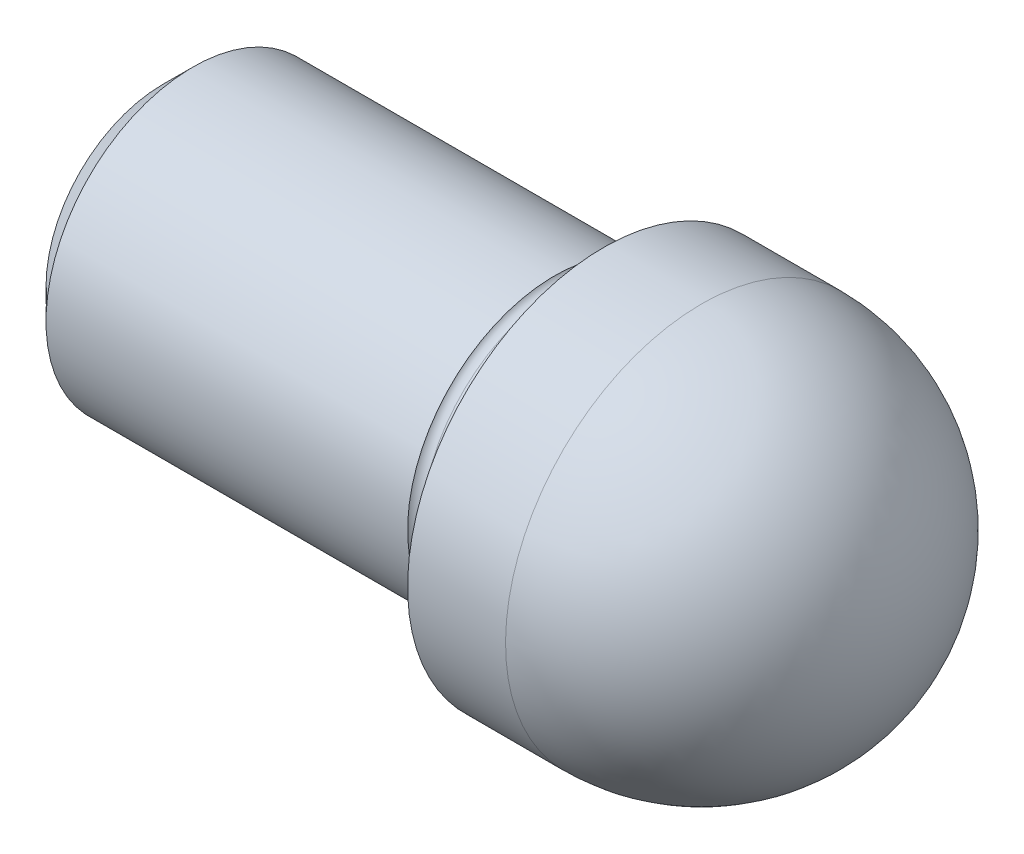
ISO-10303-21;
HEADER;
FILE_DESCRIPTION(('STEP AP214'),'2;1');
FILE_NAME('part.step','',(''),(''),'','','');
FILE_SCHEMA(('AUTOMOTIVE_DESIGN { 1 0 10303 214 1 1 1 1 }'));
ENDSEC;
DATA;
#1=APPLICATION_CONTEXT('core data for automotive mechanical design processes');
#2=APPLICATION_PROTOCOL_DEFINITION('international standard','automotive_design',2000,#1);
#3=PRODUCT_CONTEXT('',#1,'mechanical');
#4=PRODUCT('Part','Part','',(#3));
#5=PRODUCT_RELATED_PRODUCT_CATEGORY('part','',(#4));
#6=PRODUCT_DEFINITION_FORMATION('','',#4);
#7=PRODUCT_DEFINITION_CONTEXT('part definition',#1,'design');
#8=PRODUCT_DEFINITION('design','',#6,#7);
#9=PRODUCT_DEFINITION_SHAPE('','',#8);
#10=(LENGTH_UNIT() NAMED_UNIT(*) SI_UNIT(.MILLI.,.METRE.));
#11=(NAMED_UNIT(*) PLANE_ANGLE_UNIT() SI_UNIT($,.RADIAN.));
#12=(NAMED_UNIT(*) SI_UNIT($,.STERADIAN.) SOLID_ANGLE_UNIT());
#13=UNCERTAINTY_MEASURE_WITH_UNIT(LENGTH_MEASURE(1.E-05),#10,'distance_accuracy_value','');
#14=(GEOMETRIC_REPRESENTATION_CONTEXT(3) GLOBAL_UNCERTAINTY_ASSIGNED_CONTEXT((#13)) GLOBAL_UNIT_ASSIGNED_CONTEXT((#10,
#11,#12)) REPRESENTATION_CONTEXT('',''));
#15=CARTESIAN_POINT('',(0.,0.,0.));
#16=DIRECTION('',(0.,0.,1.));
#17=DIRECTION('',(1.,0.,0.));
#18=AXIS2_PLACEMENT_3D('',#15,#16,#17);
#19=CARTESIAN_POINT('',(-9.,0.,0.));
#20=DIRECTION('',(1.,0.,0.));
#21=DIRECTION('',(0.,0.,-1.));
#22=AXIS2_PLACEMENT_3D('',#19,#20,#21);
#23=PLANE('',#22);
#24=CARTESIAN_POINT('',(-9.,0.,0.));
#25=DIRECTION('',(1.,0.,0.));
#26=DIRECTION('',(0.,0.,-1.));
#27=AXIS2_PLACEMENT_3D('',#24,#25,#26);
#28=CIRCLE('',#27,2.3865);
#29=CARTESIAN_POINT('',(-9.,0.,-2.3865));
#30=VERTEX_POINT('',#29);
#31=EDGE_CURVE('E132',#30,#30,#28,.T.);
#32=ORIENTED_EDGE('',*,*,#31,.F.);
#33=EDGE_LOOP('',(#32));
#34=FACE_BOUND('',#33,.T.);
#35=ADVANCED_FACE('F24',(#34),#23,.F.);
#36=CARTESIAN_POINT('',(-9.,0.,0.));
#37=DIRECTION('',(1.,0.,0.));
#38=DIRECTION('',(0.,0.,-1.));
#39=AXIS2_PLACEMENT_3D('',#36,#37,#38);
#40=CONICAL_SURFACE('',#39,2.3865,0.785398163397448);
#41=CARTESIAN_POINT('',(-8.3865,0.,0.));
#42=DIRECTION('',(1.,0.,0.));
#43=DIRECTION('',(0.,0.,-1.));
#44=AXIS2_PLACEMENT_3D('',#41,#42,#43);
#45=CIRCLE('',#44,3.);
#46=CARTESIAN_POINT('',(-8.3865,0.,-3.));
#47=VERTEX_POINT('',#46);
#48=EDGE_CURVE('E134',#47,#47,#45,.T.);
#49=ORIENTED_EDGE('',*,*,#48,.F.);
#50=EDGE_LOOP('',(#49));
#51=FACE_BOUND('',#50,.T.);
#52=ORIENTED_EDGE('',*,*,#31,.T.);
#53=EDGE_LOOP('',(#52));
#54=FACE_BOUND('',#53,.T.);
#55=ADVANCED_FACE('F120',(#51,#54),#40,.T.);
#56=CARTESIAN_POINT('',(2.,0.,0.));
#57=DIRECTION('',(1.,0.,0.));
#58=DIRECTION('',(0.,0.,-1.));
#59=AXIS2_PLACEMENT_3D('',#56,#57,#58);
#60=CYLINDRICAL_SURFACE('',#59,3.);
#61=CARTESIAN_POINT('',(-1.,0.,0.));
#62=DIRECTION('',(1.,0.,0.));
#63=DIRECTION('',(0.,0.,-1.));
#64=AXIS2_PLACEMENT_3D('',#61,#62,#63);
#65=CIRCLE('',#64,3.);
#66=CARTESIAN_POINT('',(-1.,0.,-3.));
#67=VERTEX_POINT('',#66);
#68=EDGE_CURVE('E137',#67,#67,#65,.T.);
#69=ORIENTED_EDGE('',*,*,#68,.F.);
#70=EDGE_LOOP('',(#69));
#71=FACE_BOUND('',#70,.T.);
#72=ORIENTED_EDGE('',*,*,#48,.T.);
#73=EDGE_LOOP('',(#72));
#74=FACE_BOUND('',#73,.T.);
#75=ADVANCED_FACE('F116',(#71,#74),#60,.T.);
#76=CARTESIAN_POINT('',(-0.826794919243147,0.,0.));
#77=DIRECTION('',(1.,0.,0.));
#78=DIRECTION('',(0.,0.,-1.));
#79=AXIS2_PLACEMENT_3D('',#76,#77,#78);
#80=TOROIDAL_SURFACE('',#79,3.09999999999994,0.199999999999939);
#81=CARTESIAN_POINT('',(-0.826794919243113,0.,0.));
#82=DIRECTION('',(1.,0.,0.));
#83=DIRECTION('',(0.,0.,-1.));
#84=AXIS2_PLACEMENT_3D('',#81,#82,#83);
#85=CIRCLE('',#84,2.9);
#86=CARTESIAN_POINT('',(-0.826794919243113,0.,-2.9));
#87=VERTEX_POINT('',#86);
#88=EDGE_CURVE('E142',#87,#87,#85,.T.);
#89=ORIENTED_EDGE('',*,*,#88,.F.);
#90=EDGE_LOOP('',(#89));
#91=FACE_BOUND('',#90,.T.);
#92=ORIENTED_EDGE('',*,*,#68,.T.);
#93=EDGE_LOOP('',(#92));
#94=FACE_BOUND('',#93,.T.);
#95=ADVANCED_FACE('F112',(#91,#94),#80,.F.);
#96=CARTESIAN_POINT('',(50.,0.,0.));
#97=DIRECTION('',(1.,0.,0.));
#98=DIRECTION('',(0.,0.,-1.));
#99=AXIS2_PLACEMENT_3D('',#96,#97,#98);
#100=CYLINDRICAL_SURFACE('',#99,2.9);
#101=CARTESIAN_POINT('',(-0.2,0.,0.));
#102=DIRECTION('',(1.,0.,0.));
#103=DIRECTION('',(0.,0.,-1.));
#104=AXIS2_PLACEMENT_3D('',#101,#102,#103);
#105=CIRCLE('',#104,2.9);
#106=CARTESIAN_POINT('',(-0.2,0.,-2.9));
#107=VERTEX_POINT('',#106);
#108=EDGE_CURVE('E145',#107,#107,#105,.T.);
#109=ORIENTED_EDGE('',*,*,#108,.F.);
#110=EDGE_LOOP('',(#109));
#111=FACE_BOUND('',#110,.T.);
#112=ORIENTED_EDGE('',*,*,#88,.T.);
#113=EDGE_LOOP('',(#112));
#114=FACE_BOUND('',#113,.T.);
#115=ADVANCED_FACE('F108',(#111,#114),#100,.T.);
#116=CARTESIAN_POINT('',(-0.200000000000016,0.,0.));
#117=DIRECTION('',(1.,0.,0.));
#118=DIRECTION('',(0.,0.,-1.));
#119=AXIS2_PLACEMENT_3D('',#116,#117,#118);
#120=TOROIDAL_SURFACE('',#119,3.1,0.200000000000016);
#121=CARTESIAN_POINT('',(0.,0.,0.));
#122=DIRECTION('',(1.,0.,0.));
#123=DIRECTION('',(0.,0.,-1.));
#124=AXIS2_PLACEMENT_3D('',#121,#122,#123);
#125=CIRCLE('',#124,3.1);
#126=CARTESIAN_POINT('',(0.,0.,-3.1));
#127=VERTEX_POINT('',#126);
#128=EDGE_CURVE('E148',#127,#127,#125,.T.);
#129=ORIENTED_EDGE('',*,*,#128,.F.);
#130=EDGE_LOOP('',(#129));
#131=FACE_BOUND('',#130,.T.);
#132=ORIENTED_EDGE('',*,*,#108,.T.);
#133=EDGE_LOOP('',(#132));
#134=FACE_BOUND('',#133,.T.);
#135=ADVANCED_FACE('F104',(#131,#134),#120,.F.);
#136=CARTESIAN_POINT('',(0.,3.1,0.));
#137=DIRECTION('',(1.,0.,0.));
#138=DIRECTION('',(0.,0.,-1.));
#139=AXIS2_PLACEMENT_3D('',#136,#137,#138);
#140=PLANE('',#139);
#141=CARTESIAN_POINT('',(0.,0.,0.));
#142=DIRECTION('',(1.,0.,0.));
#143=DIRECTION('',(0.,0.,-1.));
#144=AXIS2_PLACEMENT_3D('',#141,#142,#143);
#145=CIRCLE('',#144,4.);
#146=CARTESIAN_POINT('',(0.,0.,-4.));
#147=VERTEX_POINT('',#146);
#148=EDGE_CURVE('E53',#147,#147,#145,.T.);
#149=ORIENTED_EDGE('',*,*,#148,.F.);
#150=EDGE_LOOP('',(#149));
#151=FACE_BOUND('',#150,.T.);
#152=ORIENTED_EDGE('',*,*,#128,.T.);
#153=EDGE_LOOP('',(#152));
#154=FACE_BOUND('',#153,.T.);
#155=ADVANCED_FACE('F85',(#151,#154),#140,.F.);
#156=CARTESIAN_POINT('',(2.,0.,0.));
#157=DIRECTION('',(1.,0.,0.));
#158=DIRECTION('',(0.,0.,-1.));
#159=AXIS2_PLACEMENT_3D('',#156,#157,#158);
#160=CYLINDRICAL_SURFACE('',#159,4.);
#161=CARTESIAN_POINT('',(2.,0.,-4.));
#162=CARTESIAN_POINT('',(2.,0.0654499130435605,-4.0000013883551));
#163=CARTESIAN_POINT('',(2.,0.130899707951708,-3.99839366850061));
#164=CARTESIAN_POINT('',(2.,0.261641686667636,-3.99196998114077));
#165=CARTESIAN_POINT('',(2.,0.326933870475416,-3.98715401363542));
#166=CARTESIAN_POINT('',(2.,0.457203252161068,-3.97432379974216));
#167=CARTESIAN_POINT('',(2.,0.52218045003894,-3.96630955335426));
#168=CARTESIAN_POINT('',(2.,0.651663345603954,-3.94710252636399));
#169=CARTESIAN_POINT('',(2.,0.716169043291096,-3.93590974576162));
#170=CARTESIAN_POINT('',(2.,0.84455353283793,-3.91037249746422));
#171=CARTESIAN_POINT('',(2.,0.908432324697622,-3.89602802976919));
#172=CARTESIAN_POINT('',(2.,1.03540911452849,-3.86422199578717));
#173=CARTESIAN_POINT('',(2.,1.09850711249966,-3.84676042950018));
#174=CARTESIAN_POINT('',(2.,1.22377030553603,-3.80876225635749));
#175=CARTESIAN_POINT('',(2.,1.28593550060123,-3.7882256495018));
#176=CARTESIAN_POINT('',(2.,1.40918332653653,-3.74412687196237));
#177=CARTESIAN_POINT('',(2.,1.47026595740663,-3.72056470127864));
#178=CARTESIAN_POINT('',(2.,1.59120150151408,-3.67047155881165));
#179=CARTESIAN_POINT('',(2.,1.65105441475143,-3.64394058702839));
#180=CARTESIAN_POINT('',(2.,1.76938633269083,-3.58797375795916));
#181=CARTESIAN_POINT('',(2.,1.82786533739289,-3.5585379006732));
#182=CARTESIAN_POINT('',(2.,1.9433085572151,-3.49683221411365));
#183=CARTESIAN_POINT('',(2.,2.00027277233525,-3.46456238484006));
#184=CARTESIAN_POINT('',(2.,2.11254918121052,-3.39726649516212));
#185=CARTESIAN_POINT('',(2.,2.16786137496565,-3.36224043475776));
#186=CARTESIAN_POINT('',(2.,2.27670048919117,-3.2895164636626));
#187=CARTESIAN_POINT('',(2.,2.33022740966158,-3.25181855297179));
#188=CARTESIAN_POINT('',(2.,2.43536702627789,-3.17384169887337));
#189=CARTESIAN_POINT('',(2.,2.4869797224238,-3.13356275546574));
#190=CARTESIAN_POINT('',(2.,2.58816655088536,-3.05052087143615));
#191=CARTESIAN_POINT('',(2.,2.63774068320101,-3.00775793081418));
#192=CARTESIAN_POINT('',(2.,2.73473095557513,-2.91985107202549));
#193=CARTESIAN_POINT('',(2.,2.7821470956336,-2.87470715385878));
#194=CARTESIAN_POINT('',(2.,2.87470715385878,-2.7821470956336));
#195=CARTESIAN_POINT('',(2.,2.91985107202549,-2.73473095557513));
#196=CARTESIAN_POINT('',(2.,3.00775793081418,-2.63774068320101));
#197=CARTESIAN_POINT('',(2.,3.05052087143615,-2.58816655088536));
#198=CARTESIAN_POINT('',(2.,3.13356275546574,-2.4869797224238));
#199=CARTESIAN_POINT('',(2.,3.17384169887337,-2.43536702627789));
#200=CARTESIAN_POINT('',(2.,3.25181855297179,-2.33022740966158));
#201=CARTESIAN_POINT('',(2.,3.2895164636626,-2.27670048919117));
#202=CARTESIAN_POINT('',(2.,3.36224043475776,-2.16786137496565));
#203=CARTESIAN_POINT('',(2.,3.39726649516212,-2.11254918121052));
#204=CARTESIAN_POINT('',(2.,3.46456238484006,-2.00027277233525));
#205=CARTESIAN_POINT('',(2.,3.49683221411364,-1.9433085572151));
#206=CARTESIAN_POINT('',(2.,3.55853790067319,-1.82786533739289));
#207=CARTESIAN_POINT('',(2.,3.58797375795916,-1.76938633269083));
#208=CARTESIAN_POINT('',(2.,3.64394058702839,-1.65105441475143));
#209=CARTESIAN_POINT('',(2.,3.67047155881165,-1.59120150151408));
#210=CARTESIAN_POINT('',(2.,3.72056470127864,-1.47026595740663));
#211=CARTESIAN_POINT('',(2.,3.74412687196237,-1.40918332653653));
#212=CARTESIAN_POINT('',(2.,3.7882256495018,-1.28593550060123));
#213=CARTESIAN_POINT('',(2.,3.80876225635749,-1.22377030553603));
#214=CARTESIAN_POINT('',(2.,3.84676042950018,-1.09850711249966));
#215=CARTESIAN_POINT('',(2.,3.86422199578717,-1.03540911452849));
#216=CARTESIAN_POINT('',(2.,3.89602802976919,-0.908432324697622));
#217=CARTESIAN_POINT('',(2.,3.91037249746422,-0.84455353283793));
#218=CARTESIAN_POINT('',(2.,3.93590974576162,-0.716169043291096));
#219=CARTESIAN_POINT('',(2.,3.94710252636399,-0.651663345603954));
#220=CARTESIAN_POINT('',(2.,3.96630955335426,-0.52218045003894));
#221=CARTESIAN_POINT('',(2.,3.97432379974216,-0.457203252161069));
#222=CARTESIAN_POINT('',(2.,3.98715401363542,-0.326933870475417));
#223=CARTESIAN_POINT('',(2.,3.99196998114077,-0.261641686667637));
#224=CARTESIAN_POINT('',(2.,3.99839366850061,-0.130899707951708));
#225=CARTESIAN_POINT('',(2.,4.0000013883551,-0.0654499130435607));
#226=CARTESIAN_POINT('',(2.,4.,0.));
#227=B_SPLINE_CURVE_WITH_KNOTS('',3,(#161,#162,#163,#164,#165,#166,#167,#168,#169,#170,#171,
#172,#173,#174,#175,#176,#177,#178,#179,#180,#181,#182,#183,#184,#185,#186,#187,#188,#189,#190,
#191,#192,#193,#194,#195,#196,#197,#198,#199,#200,#201,#202,#203,#204,#205,#206,#207,#208,#209,
#210,#211,#212,#213,#214,#215,#216,#217,#218,#219,#220,#221,#222,#223,#224,#225,#226),
.UNSPECIFIED.,.F.,.F.,(4,2,2,2,2,2,2,2,2,2,2,2,2,2,2,2,2,2,2,2,2,2,2,2,2,2,2,2,2,2,2,2,4),(0.,
0.196329828183298,0.392659656366597,0.588989484549895,0.785319312733193,0.981649140916492,
1.17797896909979,1.37430879728309,1.57063862546639,1.76696845364969,1.96329828183298,
2.15962811001628,2.35595793819958,2.55228776638288,2.74861759456618,2.94494742274947,
3.14127725093277,3.33760707911607,3.53393690729937,3.73026673548267,3.92659656366597,
4.12292639184927,4.31925622003256,4.51558604821586,4.71191587639916,4.90824570458246,
5.10457553276576,5.30090536094905,5.49723518913235,5.69356501731565,5.88989484549895,
6.08622467368225,6.28255450186554),.UNSPECIFIED.);
#228=CARTESIAN_POINT('',(2.,0.,-4.));
#229=VERTEX_POINT('',#228);
#230=CARTESIAN_POINT('',(2.,4.,0.));
#231=VERTEX_POINT('',#230);
#232=EDGE_CURVE('E47',#229,#231,#227,.T.);
#233=ORIENTED_EDGE('',*,*,#232,.F.);
#234=CARTESIAN_POINT('',(2.,-4.,0.));
#235=CARTESIAN_POINT('',(2.,-4.0000013883551,-0.0654499130435602));
#236=CARTESIAN_POINT('',(2.,-3.99839366850061,-0.130899707951707));
#237=CARTESIAN_POINT('',(2.,-3.99196998114077,-0.261641686667635));
#238=CARTESIAN_POINT('',(2.,-3.98715401363541,-0.326933870475415));
#239=CARTESIAN_POINT('',(2.,-3.97432379974216,-0.457203252161067));
#240=CARTESIAN_POINT('',(2.,-3.96630955335426,-0.522180450038938));
#241=CARTESIAN_POINT('',(2.,-3.94710252636399,-0.651663345603952));
#242=CARTESIAN_POINT('',(2.,-3.93590974576162,-0.716169043291095));
#243=CARTESIAN_POINT('',(2.,-3.91037249746422,-0.84455353283793));
#244=CARTESIAN_POINT('',(2.,-3.89602802976919,-0.908432324697622));
#245=CARTESIAN_POINT('',(2.,-3.86422199578717,-1.03540911452849));
#246=CARTESIAN_POINT('',(2.,-3.84676042950018,-1.09850711249966));
#247=CARTESIAN_POINT('',(2.,-3.80876225635749,-1.22377030553603));
#248=CARTESIAN_POINT('',(2.,-3.7882256495018,-1.28593550060123));
#249=CARTESIAN_POINT('',(2.,-3.74412687196237,-1.40918332653653));
#250=CARTESIAN_POINT('',(2.,-3.72056470127864,-1.47026595740664));
#251=CARTESIAN_POINT('',(2.,-3.67047155881165,-1.59120150151409));
#252=CARTESIAN_POINT('',(2.,-3.64394058702839,-1.65105441475143));
#253=CARTESIAN_POINT('',(2.,-3.58797375795916,-1.76938633269083));
#254=CARTESIAN_POINT('',(2.,-3.55853790067319,-1.82786533739289));
#255=CARTESIAN_POINT('',(2.,-3.49683221411365,-1.9433085572151));
#256=CARTESIAN_POINT('',(2.,-3.46456238484006,-2.00027277233525));
#257=CARTESIAN_POINT('',(2.,-3.39726649516212,-2.11254918121052));
#258=CARTESIAN_POINT('',(2.,-3.36224043475776,-2.16786137496565));
#259=CARTESIAN_POINT('',(2.,-3.2895164636626,-2.27670048919117));
#260=CARTESIAN_POINT('',(2.,-3.2518185529718,-2.33022740966157));
#261=CARTESIAN_POINT('',(2.,-3.17384169887337,-2.43536702627789));
#262=CARTESIAN_POINT('',(2.,-3.13356275546575,-2.4869797224238));
#263=CARTESIAN_POINT('',(2.,-3.05052087143615,-2.58816655088536));
#264=CARTESIAN_POINT('',(2.,-3.00775793081418,-2.63774068320101));
#265=CARTESIAN_POINT('',(2.,-2.91985107202549,-2.73473095557513));
#266=CARTESIAN_POINT('',(2.,-2.87470715385878,-2.7821470956336));
#267=CARTESIAN_POINT('',(2.,-2.7821470956336,-2.87470715385878));
#268=CARTESIAN_POINT('',(2.,-2.73473095557513,-2.91985107202549));
#269=CARTESIAN_POINT('',(2.,-2.63774068320102,-3.00775793081418));
#270=CARTESIAN_POINT('',(2.,-2.58816655088537,-3.05052087143615));
#271=CARTESIAN_POINT('',(2.,-2.4869797224238,-3.13356275546574));
#272=CARTESIAN_POINT('',(2.,-2.43536702627789,-3.17384169887337));
#273=CARTESIAN_POINT('',(2.,-2.33022740966158,-3.25181855297179));
#274=CARTESIAN_POINT('',(2.,-2.27670048919117,-3.2895164636626));
#275=CARTESIAN_POINT('',(2.,-2.16786137496565,-3.36224043475776));
#276=CARTESIAN_POINT('',(2.,-2.11254918121053,-3.39726649516212));
#277=CARTESIAN_POINT('',(2.,-2.00027277233525,-3.46456238484006));
#278=CARTESIAN_POINT('',(2.,-1.9433085572151,-3.49683221411364));
#279=CARTESIAN_POINT('',(2.,-1.82786533739289,-3.55853790067319));
#280=CARTESIAN_POINT('',(2.,-1.76938633269083,-3.58797375795916));
#281=CARTESIAN_POINT('',(2.,-1.65105441475143,-3.64394058702839));
#282=CARTESIAN_POINT('',(2.,-1.59120150151409,-3.67047155881165));
#283=CARTESIAN_POINT('',(2.,-1.47026595740664,-3.72056470127864));
#284=CARTESIAN_POINT('',(2.,-1.40918332653653,-3.74412687196237));
#285=CARTESIAN_POINT('',(2.,-1.28593550060123,-3.78822564950179));
#286=CARTESIAN_POINT('',(2.,-1.22377030553604,-3.80876225635749));
#287=CARTESIAN_POINT('',(2.,-1.09850711249966,-3.84676042950018));
#288=CARTESIAN_POINT('',(2.,-1.03540911452849,-3.86422199578717));
#289=CARTESIAN_POINT('',(2.,-0.908432324697623,-3.89602802976919));
#290=CARTESIAN_POINT('',(2.,-0.844553532837931,-3.91037249746422));
#291=CARTESIAN_POINT('',(2.,-0.716169043291096,-3.93590974576162));
#292=CARTESIAN_POINT('',(2.,-0.651663345603953,-3.94710252636399));
#293=CARTESIAN_POINT('',(2.,-0.522180450038939,-3.96630955335426));
#294=CARTESIAN_POINT('',(2.,-0.457203252161067,-3.97432379974216));
#295=CARTESIAN_POINT('',(2.,-0.326933870475415,-3.98715401363542));
#296=CARTESIAN_POINT('',(2.,-0.261641686667635,-3.99196998114077));
#297=CARTESIAN_POINT('',(2.,-0.130899707951708,-3.99839366850061));
#298=CARTESIAN_POINT('',(2.,-0.0654499130435603,-4.0000013883551));
#299=CARTESIAN_POINT('',(2.,0.,-4.));
#300=B_SPLINE_CURVE_WITH_KNOTS('',3,(#234,#235,#236,#237,#238,#239,#240,#241,#242,#243,#244,
#245,#246,#247,#248,#249,#250,#251,#252,#253,#254,#255,#256,#257,#258,#259,#260,#261,#262,#263,
#264,#265,#266,#267,#268,#269,#270,#271,#272,#273,#274,#275,#276,#277,#278,#279,#280,#281,#282,
#283,#284,#285,#286,#287,#288,#289,#290,#291,#292,#293,#294,#295,#296,#297,#298,#299),
.UNSPECIFIED.,.F.,.F.,(4,2,2,2,2,2,2,2,2,2,2,2,2,2,2,2,2,2,2,2,2,2,2,2,2,2,2,2,2,2,2,2,4),(0.,
0.196329828183297,0.392659656366595,0.588989484549892,0.785319312733192,0.981649140916491,
1.17797896909979,1.37430879728309,1.57063862546639,1.76696845364969,1.96329828183298,
2.15962811001628,2.35595793819958,2.55228776638288,2.74861759456618,2.94494742274947,
3.14127725093277,3.33760707911607,3.53393690729937,3.73026673548267,3.92659656366596,
4.12292639184926,4.31925622003256,4.51558604821586,4.71191587639916,4.90824570458245,
5.10457553276575,5.30090536094905,5.49723518913235,5.69356501731565,5.88989484549895,
6.08622467368225,6.28255450186554),.UNSPECIFIED.);
#301=CARTESIAN_POINT('',(2.,-4.,0.));
#302=VERTEX_POINT('',#301);
#303=EDGE_CURVE('E35',#302,#229,#300,.T.);
#304=ORIENTED_EDGE('',*,*,#303,.F.);
#305=CARTESIAN_POINT('',(2.,4.,0.));
#306=CARTESIAN_POINT('',(2.,4.0000013883551,0.065449913043561));
#307=CARTESIAN_POINT('',(2.,3.99839366850061,0.130899707951709));
#308=CARTESIAN_POINT('',(2.,3.99196998114077,0.261641686667637));
#309=CARTESIAN_POINT('',(2.,3.98715401363542,0.326933870475417));
#310=CARTESIAN_POINT('',(2.,3.97432379974216,0.457203252161068));
#311=CARTESIAN_POINT('',(2.,3.96630955335426,0.52218045003894));
#312=CARTESIAN_POINT('',(2.,3.94710252636399,0.651663345603954));
#313=CARTESIAN_POINT('',(2.,3.93590974576162,0.716169043291096));
#314=CARTESIAN_POINT('',(2.,3.91037249746422,0.84455353283793));
#315=CARTESIAN_POINT('',(2.,3.89602802976919,0.908432324697623));
#316=CARTESIAN_POINT('',(2.,3.86422199578716,1.03540911452849));
#317=CARTESIAN_POINT('',(2.,3.84676042950018,1.09850711249967));
#318=CARTESIAN_POINT('',(2.,3.80876225635749,1.22377030553604));
#319=CARTESIAN_POINT('',(2.,3.7882256495018,1.28593550060123));
#320=CARTESIAN_POINT('',(2.,3.74412687196237,1.40918332653653));
#321=CARTESIAN_POINT('',(2.,3.72056470127864,1.47026595740663));
#322=CARTESIAN_POINT('',(2.,3.67047155881165,1.59120150151408));
#323=CARTESIAN_POINT('',(2.,3.64394058702839,1.65105441475143));
#324=CARTESIAN_POINT('',(2.,3.58797375795916,1.76938633269083));
#325=CARTESIAN_POINT('',(2.,3.55853790067319,1.82786533739289));
#326=CARTESIAN_POINT('',(2.,3.49683221411364,1.9433085572151));
#327=CARTESIAN_POINT('',(2.,3.46456238484006,2.00027277233525));
#328=CARTESIAN_POINT('',(2.,3.39726649516212,2.11254918121052));
#329=CARTESIAN_POINT('',(2.,3.36224043475776,2.16786137496565));
#330=CARTESIAN_POINT('',(2.,3.2895164636626,2.27670048919117));
#331=CARTESIAN_POINT('',(2.,3.25181855297179,2.33022740966158));
#332=CARTESIAN_POINT('',(2.,3.17384169887336,2.43536702627789));
#333=CARTESIAN_POINT('',(2.,3.13356275546574,2.4869797224238));
#334=CARTESIAN_POINT('',(2.,3.05052087143615,2.58816655088536));
#335=CARTESIAN_POINT('',(2.,3.00775793081418,2.63774068320102));
#336=CARTESIAN_POINT('',(2.,2.91985107202549,2.73473095557513));
#337=CARTESIAN_POINT('',(2.,2.87470715385878,2.7821470956336));
#338=CARTESIAN_POINT('',(2.,2.7821470956336,2.87470715385878));
#339=CARTESIAN_POINT('',(2.,2.73473095557513,2.9198510720255));
#340=CARTESIAN_POINT('',(2.,2.63774068320101,3.00775793081418));
#341=CARTESIAN_POINT('',(2.,2.58816655088536,3.05052087143614));
#342=CARTESIAN_POINT('',(2.,2.4869797224238,3.13356275546576));
#343=CARTESIAN_POINT('',(2.,2.43536702627789,3.17384169887342));
#344=CARTESIAN_POINT('',(2.,2.33022740966157,3.25181855297174));
#345=CARTESIAN_POINT('',(2.,2.27670048919116,3.28951646366241));
#346=CARTESIAN_POINT('',(2.,2.16786137496565,3.36224043475795));
#347=CARTESIAN_POINT('',(2.,2.11254918121056,3.39726649516283));
#348=CARTESIAN_POINT('',(2.,2.00027277233521,3.46456238483935));
#349=CARTESIAN_POINT('',(2.,1.94330855721497,3.496832214111));
#350=CARTESIAN_POINT('',(2.,1.82786533739302,3.55853790067584));
#351=CARTESIAN_POINT('',(2.,1.76938633269131,3.58797375796904));
#352=CARTESIAN_POINT('',(2.,1.65105441475094,3.6439405870185));
#353=CARTESIAN_POINT('',(2.,1.59120150151227,3.67047155877476));
#354=CARTESIAN_POINT('',(2.,1.47026595740845,3.72056470131553));
#355=CARTESIAN_POINT('',(2.,1.40918332654329,3.74412687210005));
#356=CARTESIAN_POINT('',(2.,1.28593550059447,3.78822564936412));
#357=CARTESIAN_POINT('',(2.,1.22377030551079,3.80876225584367));
#358=CARTESIAN_POINT('',(2.,1.09850711252491,3.846760430014));
#359=CARTESIAN_POINT('',(2.,1.0354091146227,3.86422199770479));
#360=CARTESIAN_POINT('',(2.,0.908432324603415,3.89602802785157));
#361=CARTESIAN_POINT('',(2.,0.844553532486346,3.91037249030756));
#362=CARTESIAN_POINT('',(2.,0.716169043642679,3.93590975291828));
#363=CARTESIAN_POINT('',(2.,0.651663346916082,3.94710255307301));
#364=CARTESIAN_POINT('',(2.,0.522180448726808,3.96630952664524));
#365=CARTESIAN_POINT('',(2.,0.457203247264131,3.97432370006275));
#366=CARTESIAN_POINT('',(2.,0.326933875372351,3.98715411331483));
#367=CARTESIAN_POINT('',(2.,0.261641704943247,3.9919703531494));
#368=CARTESIAN_POINT('',(2.,0.130899689676096,3.99839329649198));
#369=CARTESIAN_POINT('',(2.,0.0654498448380478,4.));
#370=CARTESIAN_POINT('',(2.,-0.0654498448380484,4.));
#371=CARTESIAN_POINT('',(2.,-0.130899689676097,3.99839329649198));
#372=CARTESIAN_POINT('',(2.,-0.261641704943249,3.9919703531494));
#373=CARTESIAN_POINT('',(2.,-0.326933875372354,3.98715411331483));
#374=CARTESIAN_POINT('',(2.,-0.457203247264135,3.97432370006275));
#375=CARTESIAN_POINT('',(2.,-0.522180448726812,3.96630952664524));
#376=CARTESIAN_POINT('',(2.,-0.651663346916085,3.94710255307301));
#377=CARTESIAN_POINT('',(2.,-0.716169043642681,3.93590975291828));
#378=CARTESIAN_POINT('',(2.,-0.844553532486347,3.91037249030756));
#379=CARTESIAN_POINT('',(2.,-0.908432324603416,3.89602802785157));
#380=CARTESIAN_POINT('',(2.,-1.0354091146227,3.86422199770479));
#381=CARTESIAN_POINT('',(2.,-1.09850711252491,3.846760430014));
#382=CARTESIAN_POINT('',(2.,-1.22377030551079,3.80876225584367));
#383=CARTESIAN_POINT('',(2.,-1.28593550059447,3.78822564936412));
#384=CARTESIAN_POINT('',(2.,-1.40918332654329,3.74412687210005));
#385=CARTESIAN_POINT('',(2.,-1.47026595740845,3.72056470131553));
#386=CARTESIAN_POINT('',(2.,-1.59120150151227,3.67047155877476));
#387=CARTESIAN_POINT('',(2.,-1.65105441475094,3.6439405870185));
#388=CARTESIAN_POINT('',(2.,-1.76938633269131,3.58797375796904));
#389=CARTESIAN_POINT('',(2.,-1.82786533739302,3.55853790067584));
#390=CARTESIAN_POINT('',(2.,-1.94330855721497,3.496832214111));
#391=CARTESIAN_POINT('',(2.,-2.00027277233521,3.46456238483935));
#392=CARTESIAN_POINT('',(2.,-2.11254918121056,3.39726649516283));
#393=CARTESIAN_POINT('',(2.,-2.16786137496565,3.36224043475795));
#394=CARTESIAN_POINT('',(2.,-2.27670048919116,3.28951646366241));
#395=CARTESIAN_POINT('',(2.,-2.33022740966157,3.25181855297174));
#396=CARTESIAN_POINT('',(2.,-2.43536702627789,3.17384169887342));
#397=CARTESIAN_POINT('',(2.,-2.4869797224238,3.13356275546576));
#398=CARTESIAN_POINT('',(2.,-2.58816655088536,3.05052087143614));
#399=CARTESIAN_POINT('',(2.,-2.63774068320101,3.00775793081418));
#400=CARTESIAN_POINT('',(2.,-2.73473095557513,2.9198510720255));
#401=CARTESIAN_POINT('',(2.,-2.7821470956336,2.87470715385878));
#402=CARTESIAN_POINT('',(2.,-2.87470715385878,2.7821470956336));
#403=CARTESIAN_POINT('',(2.,-2.91985107202549,2.73473095557513));
#404=CARTESIAN_POINT('',(2.,-3.00775793081418,2.63774068320101));
#405=CARTESIAN_POINT('',(2.,-3.05052087143615,2.58816655088536));
#406=CARTESIAN_POINT('',(2.,-3.13356275546575,2.4869797224238));
#407=CARTESIAN_POINT('',(2.,-3.17384169887337,2.43536702627789));
#408=CARTESIAN_POINT('',(2.,-3.25181855297179,2.33022740966157));
#409=CARTESIAN_POINT('',(2.,-3.2895164636626,2.27670048919117));
#410=CARTESIAN_POINT('',(2.,-3.36224043475776,2.16786137496565));
#411=CARTESIAN_POINT('',(2.,-3.39726649516212,2.11254918121052));
#412=CARTESIAN_POINT('',(2.,-3.46456238484006,2.00027277233525));
#413=CARTESIAN_POINT('',(2.,-3.49683221411364,1.9433085572151));
#414=CARTESIAN_POINT('',(2.,-3.55853790067319,1.82786533739289));
#415=CARTESIAN_POINT('',(2.,-3.58797375795916,1.76938633269083));
#416=CARTESIAN_POINT('',(2.,-3.64394058702839,1.65105441475143));
#417=CARTESIAN_POINT('',(2.,-3.67047155881165,1.59120150151408));
#418=CARTESIAN_POINT('',(2.,-3.72056470127864,1.47026595740663));
#419=CARTESIAN_POINT('',(2.,-3.74412687196237,1.40918332653653));
#420=CARTESIAN_POINT('',(2.,-3.7882256495018,1.28593550060123));
#421=CARTESIAN_POINT('',(2.,-3.80876225635749,1.22377030553604));
#422=CARTESIAN_POINT('',(2.,-3.84676042950018,1.09850711249967));
#423=CARTESIAN_POINT('',(2.,-3.86422199578716,1.03540911452849));
#424=CARTESIAN_POINT('',(2.,-3.89602802976919,0.908432324697623));
#425=CARTESIAN_POINT('',(2.,-3.91037249746422,0.844553532837932));
#426=CARTESIAN_POINT('',(2.,-3.93590974576162,0.716169043291097));
#427=CARTESIAN_POINT('',(2.,-3.94710252636399,0.651663345603953));
#428=CARTESIAN_POINT('',(2.,-3.96630955335426,0.522180450038939));
#429=CARTESIAN_POINT('',(2.,-3.97432379974216,0.457203252161067));
#430=CARTESIAN_POINT('',(2.,-3.98715401363542,0.326933870475415));
#431=CARTESIAN_POINT('',(2.,-3.99196998114077,0.261641686667635));
#432=CARTESIAN_POINT('',(2.,-3.99839366850061,0.130899707951707));
#433=CARTESIAN_POINT('',(2.,-4.0000013883551,0.0654499130435602));
#434=CARTESIAN_POINT('',(2.,-4.,0.));
#435=B_SPLINE_CURVE_WITH_KNOTS('',3,(#305,#306,#307,#308,#309,#310,#311,#312,#313,#314,#315,
#316,#317,#318,#319,#320,#321,#322,#323,#324,#325,#326,#327,#328,#329,#330,#331,#332,#333,#334,
#335,#336,#337,#338,#339,#340,#341,#342,#343,#344,#345,#346,#347,#348,#349,#350,#351,#352,#353,
#354,#355,#356,#357,#358,#359,#360,#361,#362,#363,#364,#365,#366,#367,#368,#369,#370,#371,#372,
#373,#374,#375,#376,#377,#378,#379,#380,#381,#382,#383,#384,#385,#386,#387,#388,#389,#390,#391,
#392,#393,#394,#395,#396,#397,#398,#399,#400,#401,#402,#403,#404,#405,#406,#407,#408,#409,#410,
#411,#412,#413,#414,#415,#416,#417,#418,#419,#420,#421,#422,#423,#424,#425,#426,#427,#428,#429,
#430,#431,#432,#433,#434),.UNSPECIFIED.,.F.,.F.,(4,2,2,2,2,2,2,2,2,2,2,2,2,2,2,2,2,2,2,2,2,2,2,
2,2,2,2,2,2,2,2,2,2,2,2,2,2,2,2,2,2,2,2,2,2,2,2,2,2,2,2,2,2,2,2,2,2,2,2,2,2,2,2,2,4),(0.,
0.196329828183299,0.392659656366596,0.588989484549895,0.785319312733192,0.981649140916492,
1.17797896909979,1.37430879728309,1.57063862546639,1.76696845364969,1.96329828183298,
2.15962811001628,2.35595793819958,2.55228776638288,2.74861759456618,2.94494742274948,
3.14127725093277,3.33760707911607,3.53393690729937,3.73026673548267,3.92659656366597,
4.12292639184927,4.31925622003256,4.51558604821586,4.71191587639916,4.90824570458246,
5.10457553276576,5.30090536094905,5.49723518913235,5.69356501731565,5.88989484549895,
6.08622467368225,6.28255450186555,6.47888433004885,6.67521415823214,6.87154398641544,
7.06787381459874,7.26420364278204,7.46053347096534,7.65686329914863,7.85319312733193,
8.04952295551523,8.24585278369853,8.44218261188183,8.63851244006513,8.83484226824842,
9.03117209643172,9.22750192461502,9.42383175279832,9.62016158098162,9.81649140916492,
10.0128212373482,10.2091510655315,10.4054808937148,10.6018107218981,10.7981405500814,
10.9944703782647,11.190800206448,11.3871300346313,11.5834598628146,11.7797896909979,
11.9761195191812,12.1724493473645,12.3687791755478,12.5651090037311),.UNSPECIFIED.);
#436=EDGE_CURVE('E12',#231,#302,#435,.T.);
#437=ORIENTED_EDGE('',*,*,#436,.F.);
#438=EDGE_LOOP('',(#233,#304,#437));
#439=FACE_BOUND('',#438,.T.);
#440=ORIENTED_EDGE('',*,*,#148,.T.);
#441=EDGE_LOOP('',(#440));
#442=FACE_BOUND('',#441,.T.);
#443=ADVANCED_FACE('F49',(#439,#442),#160,.T.);
#444=CARTESIAN_POINT('',(2.,0.,0.));
#445=DIRECTION('',(0.,-1.,0.));
#446=DIRECTION('',(0.,0.,1.));
#447=AXIS2_PLACEMENT_3D('',#444,#445,#446);
#448=SPHERICAL_SURFACE('',#447,4.);
#449=ORIENTED_EDGE('',*,*,#232,.T.);
#450=ORIENTED_EDGE('',*,*,#436,.T.);
#451=ORIENTED_EDGE('',*,*,#303,.T.);
#452=EDGE_LOOP('',(#449,#450,#451));
#453=FACE_BOUND('',#452,.T.);
#454=ADVANCED_FACE('F26',(#453),#448,.T.);
#455=CLOSED_SHELL('',(#35,#55,#75,#95,#115,#135,#155,#443,#454));
#456=MANIFOLD_SOLID_BREP('B1',#455);
#457=ADVANCED_BREP_SHAPE_REPRESENTATION('',(#18,#456),#14);
#458=SHAPE_DEFINITION_REPRESENTATION(#9,#457);
ENDSEC;
END-ISO-10303-21;
